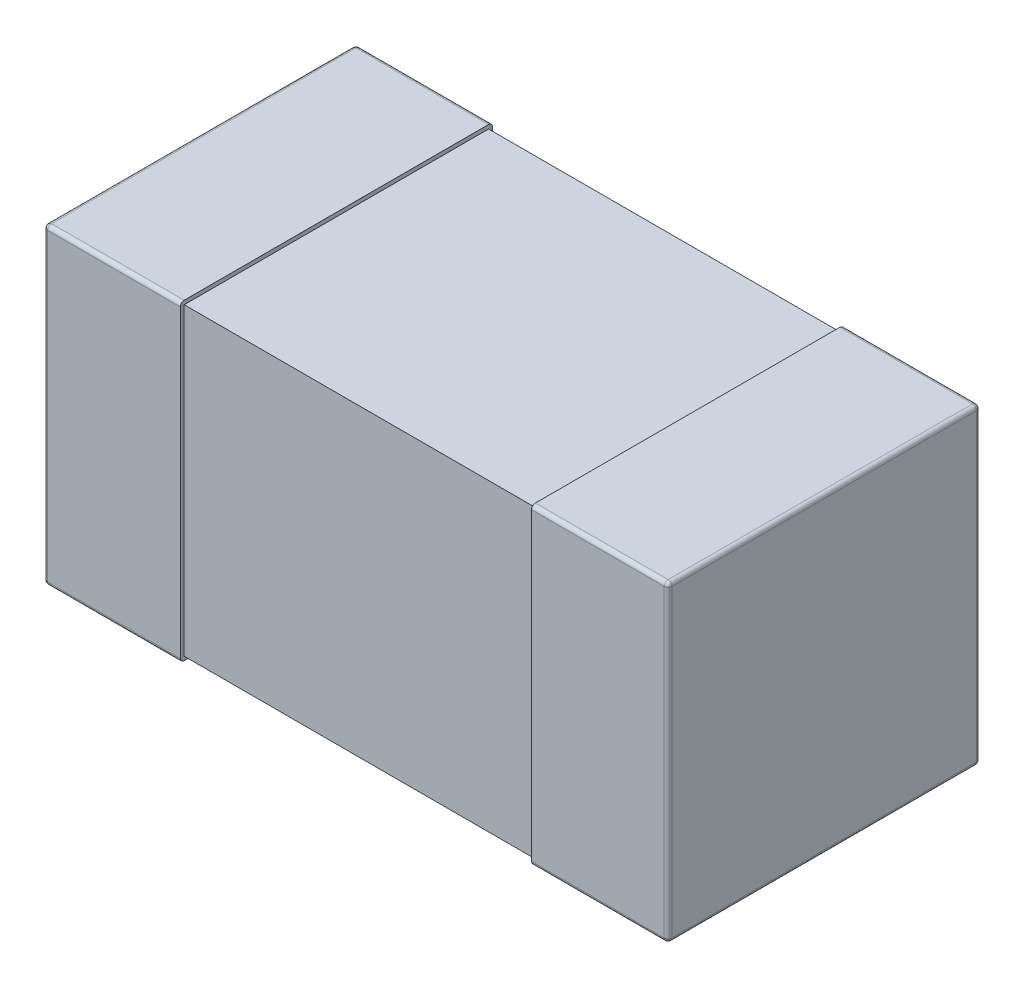
ISO-10303-21;
HEADER;
FILE_DESCRIPTION(('STEP AP214'),'2;1');
FILE_NAME('part.step','',(''),(''),'','','');
FILE_SCHEMA(('AUTOMOTIVE_DESIGN { 1 0 10303 214 1 1 1 1 }'));
ENDSEC;
DATA;
#1=APPLICATION_CONTEXT('core data for automotive mechanical design processes');
#2=APPLICATION_PROTOCOL_DEFINITION('international standard','automotive_design',2000,#1);
#3=PRODUCT_CONTEXT('',#1,'mechanical');
#4=PRODUCT('Part','Part','',(#3));
#5=PRODUCT_RELATED_PRODUCT_CATEGORY('part','',(#4));
#6=PRODUCT_DEFINITION_FORMATION('','',#4);
#7=PRODUCT_DEFINITION_CONTEXT('part definition',#1,'design');
#8=PRODUCT_DEFINITION('design','',#6,#7);
#9=PRODUCT_DEFINITION_SHAPE('','',#8);
#10=(LENGTH_UNIT() NAMED_UNIT(*) SI_UNIT(.MILLI.,.METRE.));
#11=(NAMED_UNIT(*) PLANE_ANGLE_UNIT() SI_UNIT($,.RADIAN.));
#12=(NAMED_UNIT(*) SI_UNIT($,.STERADIAN.) SOLID_ANGLE_UNIT());
#13=UNCERTAINTY_MEASURE_WITH_UNIT(LENGTH_MEASURE(1.E-05),#10,'distance_accuracy_value','');
#14=(GEOMETRIC_REPRESENTATION_CONTEXT(3) GLOBAL_UNCERTAINTY_ASSIGNED_CONTEXT((#13)) GLOBAL_UNIT_ASSIGNED_CONTEXT((#10,
#11,#12)) REPRESENTATION_CONTEXT('',''));
#15=CARTESIAN_POINT('',(0.,0.,0.));
#16=DIRECTION('',(0.,0.,1.));
#17=DIRECTION('',(1.,0.,0.));
#18=AXIS2_PLACEMENT_3D('',#15,#16,#17);
#19=CARTESIAN_POINT('',(-0.8,0.4,-0.4));
#20=DIRECTION('',(1.,0.,0.));
#21=DIRECTION('',(0.,0.,-1.));
#22=AXIS2_PLACEMENT_3D('',#19,#20,#21);
#23=PLANE('',#22);
#24=DIRECTION('',(0.,-1.,0.));
#25=VECTOR('',#24,1.);
#26=CARTESIAN_POINT('',(-0.8,0.4,-0.39));
#27=LINE('',#26,#25);
#28=CARTESIAN_POINT('',(-0.8,0.39,-0.39));
#29=VERTEX_POINT('',#28);
#30=CARTESIAN_POINT('',(-0.8,-0.39,-0.39));
#31=VERTEX_POINT('',#30);
#32=EDGE_CURVE('E352',#29,#31,#27,.T.);
#33=ORIENTED_EDGE('',*,*,#32,.T.);
#34=DIRECTION('',(0.,0.,1.));
#35=VECTOR('',#34,1.);
#36=CARTESIAN_POINT('',(-0.8,-0.39,-0.4));
#37=LINE('',#36,#35);
#38=CARTESIAN_POINT('',(-0.8,-0.39,0.39));
#39=VERTEX_POINT('',#38);
#40=EDGE_CURVE('E354',#31,#39,#37,.T.);
#41=ORIENTED_EDGE('',*,*,#40,.T.);
#42=DIRECTION('',(0.,-1.,0.));
#43=VECTOR('',#42,1.);
#44=CARTESIAN_POINT('',(-0.8,0.4,0.39));
#45=LINE('',#44,#43);
#46=CARTESIAN_POINT('',(-0.8,0.39,0.39));
#47=VERTEX_POINT('',#46);
#48=EDGE_CURVE('E350',#39,#47,#45,.F.);
#49=ORIENTED_EDGE('',*,*,#48,.T.);
#50=DIRECTION('',(0.,0.,1.));
#51=VECTOR('',#50,1.);
#52=CARTESIAN_POINT('',(-0.8,0.39,-0.4));
#53=LINE('',#52,#51);
#54=EDGE_CURVE('E348',#47,#29,#53,.F.);
#55=ORIENTED_EDGE('',*,*,#54,.T.);
#56=EDGE_LOOP('',(#33,#41,#49,#55));
#57=FACE_BOUND('',#56,.T.);
#58=ADVANCED_FACE('F37',(#57),#23,.F.);
#59=CARTESIAN_POINT('',(-0.8,0.4,0.4));
#60=DIRECTION('',(0.,0.,-1.));
#61=DIRECTION('',(-1.,0.,0.));
#62=AXIS2_PLACEMENT_3D('',#59,#60,#61);
#63=PLANE('',#62);
#64=DIRECTION('',(0.,-1.,0.));
#65=VECTOR('',#64,1.);
#66=CARTESIAN_POINT('',(-0.79,0.4,0.4));
#67=LINE('',#66,#65);
#68=CARTESIAN_POINT('',(-0.79,0.39,0.4));
#69=VERTEX_POINT('',#68);
#70=CARTESIAN_POINT('',(-0.79,-0.39,0.4));
#71=VERTEX_POINT('',#70);
#72=EDGE_CURVE('E380',#69,#71,#67,.T.);
#73=ORIENTED_EDGE('',*,*,#72,.T.);
#74=DIRECTION('',(1.,0.,0.));
#75=VECTOR('',#74,1.);
#76=CARTESIAN_POINT('',(-0.8,-0.39,0.4));
#77=LINE('',#76,#75);
#78=CARTESIAN_POINT('',(-0.45,-0.39,0.4));
#79=VERTEX_POINT('',#78);
#80=EDGE_CURVE('E382',#71,#79,#77,.T.);
#81=ORIENTED_EDGE('',*,*,#80,.T.);
#82=DIRECTION('',(0.,-1.,0.));
#83=VECTOR('',#82,1.);
#84=CARTESIAN_POINT('',(-0.45,0.4,0.4));
#85=LINE('',#84,#83);
#86=CARTESIAN_POINT('',(-0.45,0.39,0.4));
#87=VERTEX_POINT('',#86);
#88=EDGE_CURVE('E345',#87,#79,#85,.T.);
#89=ORIENTED_EDGE('',*,*,#88,.F.);
#90=DIRECTION('',(1.,0.,0.));
#91=VECTOR('',#90,1.);
#92=CARTESIAN_POINT('',(-0.8,0.39,0.4));
#93=LINE('',#92,#91);
#94=EDGE_CURVE('E378',#87,#69,#93,.F.);
#95=ORIENTED_EDGE('',*,*,#94,.T.);
#96=EDGE_LOOP('',(#73,#81,#89,#95));
#97=FACE_BOUND('',#96,.T.);
#98=ADVANCED_FACE('F451',(#97),#63,.F.);
#99=CARTESIAN_POINT('',(-0.45,0.4,-0.4));
#100=DIRECTION('',(-1.,0.,0.));
#101=DIRECTION('',(0.,0.,1.));
#102=AXIS2_PLACEMENT_3D('',#99,#100,#101);
#103=PLANE('',#102);
#104=DIRECTION('',(0.,1.,0.));
#105=VECTOR('',#104,1.);
#106=CARTESIAN_POINT('',(-0.45,0.39,-0.39));
#107=LINE('',#106,#105);
#108=CARTESIAN_POINT('',(-0.450000000000001,-0.39,-0.39));
#109=VERTEX_POINT('',#108);
#110=CARTESIAN_POINT('',(-0.45,0.39,-0.39));
#111=VERTEX_POINT('',#110);
#112=EDGE_CURVE('E211',#109,#111,#107,.T.);
#113=ORIENTED_EDGE('',*,*,#112,.F.);
#114=DIRECTION('',(0.,0.,-1.));
#115=VECTOR('',#114,1.);
#116=CARTESIAN_POINT('',(-0.45,-0.39,0.39));
#117=LINE('',#116,#115);
#118=CARTESIAN_POINT('',(-0.45,-0.39,0.39));
#119=VERTEX_POINT('',#118);
#120=EDGE_CURVE('E206',#119,#109,#117,.T.);
#121=ORIENTED_EDGE('',*,*,#120,.F.);
#122=DIRECTION('',(0.,-1.,0.));
#123=VECTOR('',#122,1.);
#124=CARTESIAN_POINT('',(-0.45,0.39,0.39));
#125=LINE('',#124,#123);
#126=CARTESIAN_POINT('',(-0.45,0.39,0.39));
#127=VERTEX_POINT('',#126);
#128=EDGE_CURVE('E327',#127,#119,#125,.T.);
#129=ORIENTED_EDGE('',*,*,#128,.F.);
#130=DIRECTION('',(0.,0.,1.));
#131=VECTOR('',#130,1.);
#132=CARTESIAN_POINT('',(-0.45,0.39,0.39));
#133=LINE('',#132,#131);
#134=EDGE_CURVE('E54',#111,#127,#133,.T.);
#135=ORIENTED_EDGE('',*,*,#134,.F.);
#136=EDGE_LOOP('',(#113,#121,#129,#135));
#137=FACE_BOUND('',#136,.T.);
#138=DIRECTION('',(0.,0.,-1.));
#139=VECTOR('',#138,1.);
#140=CARTESIAN_POINT('',(-0.45,-0.4,-0.4));
#141=LINE('',#140,#139);
#142=CARTESIAN_POINT('',(-0.45,-0.4,0.39));
#143=VERTEX_POINT('',#142);
#144=CARTESIAN_POINT('',(-0.45,-0.4,-0.39));
#145=VERTEX_POINT('',#144);
#146=EDGE_CURVE('E340',#143,#145,#141,.T.);
#147=ORIENTED_EDGE('',*,*,#146,.T.);
#148=CARTESIAN_POINT('',(-0.45,-0.39,-0.39));
#149=DIRECTION('',(-1.,0.,0.));
#150=DIRECTION('',(0.,0.,1.));
#151=AXIS2_PLACEMENT_3D('',#148,#149,#150);
#152=CIRCLE('',#151,0.01);
#153=CARTESIAN_POINT('',(-0.45,-0.39,-0.4));
#154=VERTEX_POINT('',#153);
#155=EDGE_CURVE('E376',#145,#154,#152,.F.);
#156=ORIENTED_EDGE('',*,*,#155,.T.);
#157=DIRECTION('',(0.,-1.,0.));
#158=VECTOR('',#157,1.);
#159=CARTESIAN_POINT('',(-0.45,0.4,-0.4));
#160=LINE('',#159,#158);
#161=CARTESIAN_POINT('',(-0.45,0.39,-0.4));
#162=VERTEX_POINT('',#161);
#163=EDGE_CURVE('E339',#162,#154,#160,.T.);
#164=ORIENTED_EDGE('',*,*,#163,.F.);
#165=CARTESIAN_POINT('',(-0.45,0.39,-0.39));
#166=DIRECTION('',(-1.,0.,0.));
#167=DIRECTION('',(0.,0.,1.));
#168=AXIS2_PLACEMENT_3D('',#165,#166,#167);
#169=CIRCLE('',#168,0.01);
#170=CARTESIAN_POINT('',(-0.45,0.4,-0.39));
#171=VERTEX_POINT('',#170);
#172=EDGE_CURVE('E372',#162,#171,#169,.F.);
#173=ORIENTED_EDGE('',*,*,#172,.T.);
#174=DIRECTION('',(0.,0.,-1.));
#175=VECTOR('',#174,1.);
#176=CARTESIAN_POINT('',(-0.45,0.4,-0.4));
#177=LINE('',#176,#175);
#178=CARTESIAN_POINT('',(-0.45,0.4,0.39));
#179=VERTEX_POINT('',#178);
#180=EDGE_CURVE('E337',#179,#171,#177,.T.);
#181=ORIENTED_EDGE('',*,*,#180,.F.);
#182=CARTESIAN_POINT('',(-0.45,0.39,0.39));
#183=DIRECTION('',(-1.,0.,0.));
#184=DIRECTION('',(0.,0.,1.));
#185=AXIS2_PLACEMENT_3D('',#182,#183,#184);
#186=CIRCLE('',#185,0.01);
#187=EDGE_CURVE('E370',#179,#87,#186,.F.);
#188=ORIENTED_EDGE('',*,*,#187,.T.);
#189=ORIENTED_EDGE('',*,*,#88,.T.);
#190=CARTESIAN_POINT('',(-0.45,-0.39,0.39));
#191=DIRECTION('',(-1.,0.,0.));
#192=DIRECTION('',(0.,0.,1.));
#193=AXIS2_PLACEMENT_3D('',#190,#191,#192);
#194=CIRCLE('',#193,0.01);
#195=EDGE_CURVE('E374',#79,#143,#194,.F.);
#196=ORIENTED_EDGE('',*,*,#195,.T.);
#197=EDGE_LOOP('',(#147,#156,#164,#173,#181,#188,#189,#196));
#198=FACE_BOUND('',#197,.T.);
#199=ADVANCED_FACE('F448',(#137,#198),#103,.F.);
#200=CARTESIAN_POINT('',(-0.8,0.4,-0.4));
#201=DIRECTION('',(0.,0.,1.));
#202=DIRECTION('',(1.,0.,0.));
#203=AXIS2_PLACEMENT_3D('',#200,#201,#202);
#204=PLANE('',#203);
#205=ORIENTED_EDGE('',*,*,#163,.T.);
#206=DIRECTION('',(-1.,0.,0.));
#207=VECTOR('',#206,1.);
#208=CARTESIAN_POINT('',(-0.8,-0.39,-0.4));
#209=LINE('',#208,#207);
#210=CARTESIAN_POINT('',(-0.79,-0.39,-0.4));
#211=VERTEX_POINT('',#210);
#212=EDGE_CURVE('E368',#154,#211,#209,.T.);
#213=ORIENTED_EDGE('',*,*,#212,.T.);
#214=DIRECTION('',(0.,-1.,0.));
#215=VECTOR('',#214,1.);
#216=CARTESIAN_POINT('',(-0.79,0.4,-0.4));
#217=LINE('',#216,#215);
#218=CARTESIAN_POINT('',(-0.79,0.39,-0.4));
#219=VERTEX_POINT('',#218);
#220=EDGE_CURVE('E366',#211,#219,#217,.F.);
#221=ORIENTED_EDGE('',*,*,#220,.T.);
#222=DIRECTION('',(-1.,0.,0.));
#223=VECTOR('',#222,1.);
#224=CARTESIAN_POINT('',(-0.45,0.39,-0.4));
#225=LINE('',#224,#223);
#226=EDGE_CURVE('E364',#219,#162,#225,.F.);
#227=ORIENTED_EDGE('',*,*,#226,.T.);
#228=EDGE_LOOP('',(#205,#213,#221,#227));
#229=FACE_BOUND('',#228,.T.);
#230=ADVANCED_FACE('F477',(#229),#204,.F.);
#231=CARTESIAN_POINT('',(-0.8,0.4,0.4));
#232=DIRECTION('',(0.,1.,0.));
#233=DIRECTION('',(0.,0.,1.));
#234=AXIS2_PLACEMENT_3D('',#231,#232,#233);
#235=PLANE('',#234);
#236=ORIENTED_EDGE('',*,*,#180,.T.);
#237=DIRECTION('',(-1.,0.,0.));
#238=VECTOR('',#237,1.);
#239=CARTESIAN_POINT('',(-0.8,0.4,-0.39));
#240=LINE('',#239,#238);
#241=CARTESIAN_POINT('',(-0.79,0.4,-0.39));
#242=VERTEX_POINT('',#241);
#243=EDGE_CURVE('E11',#171,#242,#240,.T.);
#244=ORIENTED_EDGE('',*,*,#243,.T.);
#245=DIRECTION('',(0.,0.,1.));
#246=VECTOR('',#245,1.);
#247=CARTESIAN_POINT('',(-0.79,0.4,0.4));
#248=LINE('',#247,#246);
#249=CARTESIAN_POINT('',(-0.79,0.4,0.39));
#250=VERTEX_POINT('',#249);
#251=EDGE_CURVE('E46',#242,#250,#248,.T.);
#252=ORIENTED_EDGE('',*,*,#251,.T.);
#253=DIRECTION('',(1.,0.,0.));
#254=VECTOR('',#253,1.);
#255=CARTESIAN_POINT('',(-0.45,0.4,0.39));
#256=LINE('',#255,#254);
#257=EDGE_CURVE('E384',#250,#179,#256,.T.);
#258=ORIENTED_EDGE('',*,*,#257,.T.);
#259=EDGE_LOOP('',(#236,#244,#252,#258));
#260=FACE_BOUND('',#259,.T.);
#261=ADVANCED_FACE('F438',(#260),#235,.T.);
#262=CARTESIAN_POINT('',(-0.8,-0.4,0.4));
#263=DIRECTION('',(0.,1.,0.));
#264=DIRECTION('',(0.,0.,1.));
#265=AXIS2_PLACEMENT_3D('',#262,#263,#264);
#266=PLANE('',#265);
#267=DIRECTION('',(0.,0.,1.));
#268=VECTOR('',#267,1.);
#269=CARTESIAN_POINT('',(-0.79,-0.4,0.4));
#270=LINE('',#269,#268);
#271=CARTESIAN_POINT('',(-0.79,-0.4,0.39));
#272=VERTEX_POINT('',#271);
#273=CARTESIAN_POINT('',(-0.79,-0.4,-0.39));
#274=VERTEX_POINT('',#273);
#275=EDGE_CURVE('E359',#272,#274,#270,.F.);
#276=ORIENTED_EDGE('',*,*,#275,.T.);
#277=DIRECTION('',(-1.,0.,0.));
#278=VECTOR('',#277,1.);
#279=CARTESIAN_POINT('',(-0.8,-0.4,-0.39));
#280=LINE('',#279,#278);
#281=EDGE_CURVE('E362',#274,#145,#280,.F.);
#282=ORIENTED_EDGE('',*,*,#281,.T.);
#283=ORIENTED_EDGE('',*,*,#146,.F.);
#284=DIRECTION('',(1.,0.,0.));
#285=VECTOR('',#284,1.);
#286=CARTESIAN_POINT('',(-0.8,-0.4,0.39));
#287=LINE('',#286,#285);
#288=EDGE_CURVE('E357',#143,#272,#287,.F.);
#289=ORIENTED_EDGE('',*,*,#288,.T.);
#290=EDGE_LOOP('',(#276,#282,#283,#289));
#291=FACE_BOUND('',#290,.T.);
#292=ADVANCED_FACE('F468',(#291),#266,.F.);
#293=CARTESIAN_POINT('',(-0.8,0.39,-0.39));
#294=DIRECTION('',(1.,0.,0.));
#295=DIRECTION('',(0.,0.,-1.));
#296=AXIS2_PLACEMENT_3D('',#293,#294,#295);
#297=CYLINDRICAL_SURFACE('',#296,0.01);
#298=ORIENTED_EDGE('',*,*,#172,.F.);
#299=ORIENTED_EDGE('',*,*,#226,.F.);
#300=CARTESIAN_POINT('',(-0.79,0.39,-0.39));
#301=DIRECTION('',(-1.,0.,0.));
#302=DIRECTION('',(0.,0.,1.));
#303=AXIS2_PLACEMENT_3D('',#300,#301,#302);
#304=CIRCLE('',#303,0.01);
#305=EDGE_CURVE('E41',#242,#219,#304,.T.);
#306=ORIENTED_EDGE('',*,*,#305,.F.);
#307=ORIENTED_EDGE('',*,*,#243,.F.);
#308=EDGE_LOOP('',(#298,#299,#306,#307));
#309=FACE_BOUND('',#308,.T.);
#310=ADVANCED_FACE('F39',(#309),#297,.T.);
#311=CARTESIAN_POINT('',(-0.79,0.39,0.4));
#312=DIRECTION('',(0.,0.,-1.));
#313=DIRECTION('',(-1.,0.,0.));
#314=AXIS2_PLACEMENT_3D('',#311,#312,#313);
#315=CYLINDRICAL_SURFACE('',#314,0.01);
#316=CARTESIAN_POINT('',(-0.79,0.39,0.39));
#317=DIRECTION('',(0.,0.,1.));
#318=DIRECTION('',(1.,0.,0.));
#319=AXIS2_PLACEMENT_3D('',#316,#317,#318);
#320=CIRCLE('',#319,0.01);
#321=EDGE_CURVE('E411',#250,#47,#320,.T.);
#322=ORIENTED_EDGE('',*,*,#321,.F.);
#323=ORIENTED_EDGE('',*,*,#251,.F.);
#324=CARTESIAN_POINT('',(-0.79,0.39,-0.39));
#325=DIRECTION('',(0.,0.,-1.));
#326=DIRECTION('',(-1.,0.,0.));
#327=AXIS2_PLACEMENT_3D('',#324,#325,#326);
#328=CIRCLE('',#327,0.01);
#329=EDGE_CURVE('E413',#29,#242,#328,.T.);
#330=ORIENTED_EDGE('',*,*,#329,.F.);
#331=ORIENTED_EDGE('',*,*,#54,.F.);
#332=EDGE_LOOP('',(#322,#323,#330,#331));
#333=FACE_BOUND('',#332,.T.);
#334=ADVANCED_FACE('F436',(#333),#315,.T.);
#335=CARTESIAN_POINT('',(-0.8,0.39,0.39));
#336=DIRECTION('',(-1.,0.,0.));
#337=DIRECTION('',(0.,0.,1.));
#338=AXIS2_PLACEMENT_3D('',#335,#336,#337);
#339=CYLINDRICAL_SURFACE('',#338,0.01);
#340=ORIENTED_EDGE('',*,*,#187,.F.);
#341=ORIENTED_EDGE('',*,*,#257,.F.);
#342=CARTESIAN_POINT('',(-0.79,0.39,0.39));
#343=DIRECTION('',(-1.,0.,0.));
#344=DIRECTION('',(0.,0.,1.));
#345=AXIS2_PLACEMENT_3D('',#342,#343,#344);
#346=CIRCLE('',#345,0.01);
#347=EDGE_CURVE('E408',#69,#250,#346,.T.);
#348=ORIENTED_EDGE('',*,*,#347,.F.);
#349=ORIENTED_EDGE('',*,*,#94,.F.);
#350=EDGE_LOOP('',(#340,#341,#348,#349));
#351=FACE_BOUND('',#350,.T.);
#352=ADVANCED_FACE('F443',(#351),#339,.T.);
#353=CARTESIAN_POINT('',(-0.79,0.39,-0.39));
#354=DIRECTION('',(0.,0.,1.));
#355=DIRECTION('',(1.,0.,0.));
#356=AXIS2_PLACEMENT_3D('',#353,#354,#355);
#357=SPHERICAL_SURFACE('',#356,0.01);
#358=ORIENTED_EDGE('',*,*,#329,.T.);
#359=ORIENTED_EDGE('',*,*,#305,.T.);
#360=CARTESIAN_POINT('',(-0.79,0.39,-0.39));
#361=DIRECTION('',(0.,1.,0.));
#362=DIRECTION('',(0.,0.,1.));
#363=AXIS2_PLACEMENT_3D('',#360,#361,#362);
#364=CIRCLE('',#363,0.01);
#365=EDGE_CURVE('E405',#29,#219,#364,.F.);
#366=ORIENTED_EDGE('',*,*,#365,.F.);
#367=EDGE_LOOP('',(#358,#359,#366));
#368=FACE_BOUND('',#367,.T.);
#369=ADVANCED_FACE('F420',(#368),#357,.T.);
#370=CARTESIAN_POINT('',(-0.79,0.39,0.39));
#371=DIRECTION('',(0.,0.,1.));
#372=DIRECTION('',(1.,0.,0.));
#373=AXIS2_PLACEMENT_3D('',#370,#371,#372);
#374=SPHERICAL_SURFACE('',#373,0.01);
#375=ORIENTED_EDGE('',*,*,#347,.T.);
#376=ORIENTED_EDGE('',*,*,#321,.T.);
#377=CARTESIAN_POINT('',(-0.79,0.39,0.39));
#378=DIRECTION('',(0.,1.,0.));
#379=DIRECTION('',(0.,0.,1.));
#380=AXIS2_PLACEMENT_3D('',#377,#378,#379);
#381=CIRCLE('',#380,0.01);
#382=EDGE_CURVE('E402',#69,#47,#381,.F.);
#383=ORIENTED_EDGE('',*,*,#382,.F.);
#384=EDGE_LOOP('',(#375,#376,#383));
#385=FACE_BOUND('',#384,.T.);
#386=ADVANCED_FACE('F509',(#385),#374,.T.);
#387=CARTESIAN_POINT('',(-0.8,-0.39,-0.39));
#388=DIRECTION('',(-1.,0.,0.));
#389=DIRECTION('',(0.,0.,1.));
#390=AXIS2_PLACEMENT_3D('',#387,#388,#389);
#391=CYLINDRICAL_SURFACE('',#390,0.01);
#392=ORIENTED_EDGE('',*,*,#155,.F.);
#393=ORIENTED_EDGE('',*,*,#281,.F.);
#394=CARTESIAN_POINT('',(-0.79,-0.39,-0.39));
#395=DIRECTION('',(-1.,0.,0.));
#396=DIRECTION('',(0.,0.,1.));
#397=AXIS2_PLACEMENT_3D('',#394,#395,#396);
#398=CIRCLE('',#397,0.01);
#399=EDGE_CURVE('E399',#211,#274,#398,.T.);
#400=ORIENTED_EDGE('',*,*,#399,.F.);
#401=ORIENTED_EDGE('',*,*,#212,.F.);
#402=EDGE_LOOP('',(#392,#393,#400,#401));
#403=FACE_BOUND('',#402,.T.);
#404=ADVANCED_FACE('F475',(#403),#391,.T.);
#405=CARTESIAN_POINT('',(-0.79,0.4,-0.39));
#406=DIRECTION('',(0.,-1.,0.));
#407=DIRECTION('',(0.,0.,-1.));
#408=AXIS2_PLACEMENT_3D('',#405,#406,#407);
#409=CYLINDRICAL_SURFACE('',#408,0.01);
#410=ORIENTED_EDGE('',*,*,#365,.T.);
#411=ORIENTED_EDGE('',*,*,#220,.F.);
#412=CARTESIAN_POINT('',(-0.79,-0.39,-0.39));
#413=DIRECTION('',(0.,-1.,0.));
#414=DIRECTION('',(0.,0.,-1.));
#415=AXIS2_PLACEMENT_3D('',#412,#413,#414);
#416=CIRCLE('',#415,0.01);
#417=EDGE_CURVE('E396',#31,#211,#416,.T.);
#418=ORIENTED_EDGE('',*,*,#417,.F.);
#419=ORIENTED_EDGE('',*,*,#32,.F.);
#420=EDGE_LOOP('',(#410,#411,#418,#419));
#421=FACE_BOUND('',#420,.T.);
#422=ADVANCED_FACE('F426',(#421),#409,.T.);
#423=CARTESIAN_POINT('',(-0.79,0.4,0.39));
#424=DIRECTION('',(0.,-1.,0.));
#425=DIRECTION('',(0.,0.,-1.));
#426=AXIS2_PLACEMENT_3D('',#423,#424,#425);
#427=CYLINDRICAL_SURFACE('',#426,0.01);
#428=ORIENTED_EDGE('',*,*,#382,.T.);
#429=ORIENTED_EDGE('',*,*,#48,.F.);
#430=CARTESIAN_POINT('',(-0.79,-0.39,0.39));
#431=DIRECTION('',(0.,-1.,0.));
#432=DIRECTION('',(0.,0.,-1.));
#433=AXIS2_PLACEMENT_3D('',#430,#431,#432);
#434=CIRCLE('',#433,0.01);
#435=EDGE_CURVE('E393',#71,#39,#434,.T.);
#436=ORIENTED_EDGE('',*,*,#435,.F.);
#437=ORIENTED_EDGE('',*,*,#72,.F.);
#438=EDGE_LOOP('',(#428,#429,#436,#437));
#439=FACE_BOUND('',#438,.T.);
#440=ADVANCED_FACE('F461',(#439),#427,.T.);
#441=CARTESIAN_POINT('',(-0.8,-0.39,0.39));
#442=DIRECTION('',(1.,0.,0.));
#443=DIRECTION('',(0.,0.,-1.));
#444=AXIS2_PLACEMENT_3D('',#441,#442,#443);
#445=CYLINDRICAL_SURFACE('',#444,0.01);
#446=ORIENTED_EDGE('',*,*,#195,.F.);
#447=ORIENTED_EDGE('',*,*,#80,.F.);
#448=CARTESIAN_POINT('',(-0.79,-0.39,0.39));
#449=DIRECTION('',(-1.,0.,0.));
#450=DIRECTION('',(0.,0.,1.));
#451=AXIS2_PLACEMENT_3D('',#448,#449,#450);
#452=CIRCLE('',#451,0.01);
#453=EDGE_CURVE('E390',#272,#71,#452,.T.);
#454=ORIENTED_EDGE('',*,*,#453,.F.);
#455=ORIENTED_EDGE('',*,*,#288,.F.);
#456=EDGE_LOOP('',(#446,#447,#454,#455));
#457=FACE_BOUND('',#456,.T.);
#458=ADVANCED_FACE('F457',(#457),#445,.T.);
#459=CARTESIAN_POINT('',(-0.79,-0.39,-0.39));
#460=DIRECTION('',(0.,0.,1.));
#461=DIRECTION('',(1.,0.,0.));
#462=AXIS2_PLACEMENT_3D('',#459,#460,#461);
#463=SPHERICAL_SURFACE('',#462,0.01);
#464=ORIENTED_EDGE('',*,*,#417,.T.);
#465=ORIENTED_EDGE('',*,*,#399,.T.);
#466=CARTESIAN_POINT('',(-0.79,-0.39,-0.39));
#467=DIRECTION('',(0.,0.,-1.));
#468=DIRECTION('',(-1.,0.,0.));
#469=AXIS2_PLACEMENT_3D('',#466,#467,#468);
#470=CIRCLE('',#469,0.01);
#471=EDGE_CURVE('E388',#31,#274,#470,.F.);
#472=ORIENTED_EDGE('',*,*,#471,.F.);
#473=EDGE_LOOP('',(#464,#465,#472));
#474=FACE_BOUND('',#473,.T.);
#475=ADVANCED_FACE('F497',(#474),#463,.T.);
#476=CARTESIAN_POINT('',(-0.79,-0.39,0.39));
#477=DIRECTION('',(0.,0.,1.));
#478=DIRECTION('',(1.,0.,0.));
#479=AXIS2_PLACEMENT_3D('',#476,#477,#478);
#480=SPHERICAL_SURFACE('',#479,0.01);
#481=ORIENTED_EDGE('',*,*,#453,.T.);
#482=ORIENTED_EDGE('',*,*,#435,.T.);
#483=CARTESIAN_POINT('',(-0.79,-0.39,0.39));
#484=DIRECTION('',(0.,0.,1.));
#485=DIRECTION('',(1.,0.,0.));
#486=AXIS2_PLACEMENT_3D('',#483,#484,#485);
#487=CIRCLE('',#486,0.01);
#488=EDGE_CURVE('E336',#272,#39,#487,.F.);
#489=ORIENTED_EDGE('',*,*,#488,.F.);
#490=EDGE_LOOP('',(#481,#482,#489));
#491=FACE_BOUND('',#490,.T.);
#492=ADVANCED_FACE('F464',(#491),#480,.T.);
#493=CARTESIAN_POINT('',(-0.79,-0.39,-0.4));
#494=DIRECTION('',(0.,0.,1.));
#495=DIRECTION('',(1.,0.,0.));
#496=AXIS2_PLACEMENT_3D('',#493,#494,#495);
#497=CYLINDRICAL_SURFACE('',#496,0.01);
#498=ORIENTED_EDGE('',*,*,#471,.T.);
#499=ORIENTED_EDGE('',*,*,#275,.F.);
#500=ORIENTED_EDGE('',*,*,#488,.T.);
#501=ORIENTED_EDGE('',*,*,#40,.F.);
#502=EDGE_LOOP('',(#498,#499,#500,#501));
#503=FACE_BOUND('',#502,.T.);
#504=ADVANCED_FACE('F466',(#503),#497,.T.);
#505=CARTESIAN_POINT('',(-1.55308657865101,-0.39,0.39));
#506=DIRECTION('',(0.,-1.,0.));
#507=DIRECTION('',(0.,0.,-1.));
#508=AXIS2_PLACEMENT_3D('',#505,#506,#507);
#509=PLANE('',#508);
#510=DIRECTION('',(1.,0.,0.));
#511=VECTOR('',#510,1.);
#512=CARTESIAN_POINT('',(-1.55308657865101,-0.39,0.39));
#513=LINE('',#512,#511);
#514=CARTESIAN_POINT('',(0.45,-0.39,0.39));
#515=VERTEX_POINT('',#514);
#516=EDGE_CURVE('E329',#119,#515,#513,.T.);
#517=ORIENTED_EDGE('',*,*,#516,.F.);
#518=ORIENTED_EDGE('',*,*,#120,.T.);
#519=DIRECTION('',(1.,0.,0.));
#520=VECTOR('',#519,1.);
#521=CARTESIAN_POINT('',(-1.55308657865101,-0.39,-0.39));
#522=LINE('',#521,#520);
#523=CARTESIAN_POINT('',(0.450000000000001,-0.39,-0.39));
#524=VERTEX_POINT('',#523);
#525=EDGE_CURVE('E199',#109,#524,#522,.T.);
#526=ORIENTED_EDGE('',*,*,#525,.T.);
#527=DIRECTION('',(0.,0.,-1.));
#528=VECTOR('',#527,1.);
#529=CARTESIAN_POINT('',(0.45,-0.39,0.39));
#530=LINE('',#529,#528);
#531=EDGE_CURVE('E203',#515,#524,#530,.T.);
#532=ORIENTED_EDGE('',*,*,#531,.F.);
#533=EDGE_LOOP('',(#517,#518,#526,#532));
#534=FACE_BOUND('',#533,.T.);
#535=ADVANCED_FACE('F202',(#534),#509,.T.);
#536=CARTESIAN_POINT('',(-1.55308657865101,0.39,-0.39));
#537=DIRECTION('',(0.,0.,-1.));
#538=DIRECTION('',(-1.,0.,0.));
#539=AXIS2_PLACEMENT_3D('',#536,#537,#538);
#540=PLANE('',#539);
#541=ORIENTED_EDGE('',*,*,#525,.F.);
#542=ORIENTED_EDGE('',*,*,#112,.T.);
#543=DIRECTION('',(1.,0.,0.));
#544=VECTOR('',#543,1.);
#545=CARTESIAN_POINT('',(-1.55308657865101,0.39,-0.39));
#546=LINE('',#545,#544);
#547=CARTESIAN_POINT('',(0.45,0.39,-0.39));
#548=VERTEX_POINT('',#547);
#549=EDGE_CURVE('E223',#111,#548,#546,.T.);
#550=ORIENTED_EDGE('',*,*,#549,.T.);
#551=DIRECTION('',(0.,1.,0.));
#552=VECTOR('',#551,1.);
#553=CARTESIAN_POINT('',(0.45,0.39,-0.39));
#554=LINE('',#553,#552);
#555=EDGE_CURVE('E218',#524,#548,#554,.T.);
#556=ORIENTED_EDGE('',*,*,#555,.F.);
#557=EDGE_LOOP('',(#541,#542,#550,#556));
#558=FACE_BOUND('',#557,.T.);
#559=ADVANCED_FACE('F222',(#558),#540,.T.);
#560=CARTESIAN_POINT('',(-1.55308657865101,0.39,0.39));
#561=DIRECTION('',(0.,1.,0.));
#562=DIRECTION('',(0.,0.,1.));
#563=AXIS2_PLACEMENT_3D('',#560,#561,#562);
#564=PLANE('',#563);
#565=ORIENTED_EDGE('',*,*,#549,.F.);
#566=ORIENTED_EDGE('',*,*,#134,.T.);
#567=DIRECTION('',(1.,0.,0.));
#568=VECTOR('',#567,1.);
#569=CARTESIAN_POINT('',(-1.55308657865101,0.39,0.39));
#570=LINE('',#569,#568);
#571=CARTESIAN_POINT('',(0.45,0.39,0.39));
#572=VERTEX_POINT('',#571);
#573=EDGE_CURVE('E330',#127,#572,#570,.T.);
#574=ORIENTED_EDGE('',*,*,#573,.T.);
#575=DIRECTION('',(0.,0.,1.));
#576=VECTOR('',#575,1.);
#577=CARTESIAN_POINT('',(0.45,0.39,0.39));
#578=LINE('',#577,#576);
#579=EDGE_CURVE('E225',#548,#572,#578,.T.);
#580=ORIENTED_EDGE('',*,*,#579,.F.);
#581=EDGE_LOOP('',(#565,#566,#574,#580));
#582=FACE_BOUND('',#581,.T.);
#583=ADVANCED_FACE('F569',(#582),#564,.T.);
#584=CARTESIAN_POINT('',(-1.55308657865101,0.39,0.39));
#585=DIRECTION('',(0.,0.,1.));
#586=DIRECTION('',(1.,0.,0.));
#587=AXIS2_PLACEMENT_3D('',#584,#585,#586);
#588=PLANE('',#587);
#589=ORIENTED_EDGE('',*,*,#573,.F.);
#590=ORIENTED_EDGE('',*,*,#128,.T.);
#591=ORIENTED_EDGE('',*,*,#516,.T.);
#592=DIRECTION('',(0.,-1.,0.));
#593=VECTOR('',#592,1.);
#594=CARTESIAN_POINT('',(0.45,0.39,0.39));
#595=LINE('',#594,#593);
#596=EDGE_CURVE('E220',#572,#515,#595,.T.);
#597=ORIENTED_EDGE('',*,*,#596,.F.);
#598=EDGE_LOOP('',(#589,#590,#591,#597));
#599=FACE_BOUND('',#598,.T.);
#600=ADVANCED_FACE('F576',(#599),#588,.T.);
#601=CARTESIAN_POINT('',(0.8,0.4,-0.4));
#602=DIRECTION('',(-1.,0.,0.));
#603=DIRECTION('',(0.,0.,-1.));
#604=AXIS2_PLACEMENT_3D('',#601,#602,#603);
#605=PLANE('',#604);
#606=DIRECTION('',(0.,-1.,0.));
#607=VECTOR('',#606,1.);
#608=CARTESIAN_POINT('',(0.8,0.4,-0.39));
#609=LINE('',#608,#607);
#610=CARTESIAN_POINT('',(0.8,0.39,-0.39));
#611=VERTEX_POINT('',#610);
#612=CARTESIAN_POINT('',(0.8,-0.39,-0.39));
#613=VERTEX_POINT('',#612);
#614=EDGE_CURVE('E249',#611,#613,#609,.T.);
#615=ORIENTED_EDGE('',*,*,#614,.F.);
#616=DIRECTION('',(0.,0.,1.));
#617=VECTOR('',#616,1.);
#618=CARTESIAN_POINT('',(0.8,0.39,-0.4));
#619=LINE('',#618,#617);
#620=CARTESIAN_POINT('',(0.8,0.39,0.39));
#621=VERTEX_POINT('',#620);
#622=EDGE_CURVE('E243',#621,#611,#619,.F.);
#623=ORIENTED_EDGE('',*,*,#622,.F.);
#624=DIRECTION('',(0.,-1.,0.));
#625=VECTOR('',#624,1.);
#626=CARTESIAN_POINT('',(0.8,0.4,0.39));
#627=LINE('',#626,#625);
#628=CARTESIAN_POINT('',(0.8,-0.39,0.39));
#629=VERTEX_POINT('',#628);
#630=EDGE_CURVE('E246',#629,#621,#627,.F.);
#631=ORIENTED_EDGE('',*,*,#630,.F.);
#632=DIRECTION('',(0.,0.,1.));
#633=VECTOR('',#632,1.);
#634=CARTESIAN_POINT('',(0.8,-0.39,-0.4));
#635=LINE('',#634,#633);
#636=EDGE_CURVE('E252',#613,#629,#635,.T.);
#637=ORIENTED_EDGE('',*,*,#636,.F.);
#638=EDGE_LOOP('',(#615,#623,#631,#637));
#639=FACE_BOUND('',#638,.T.);
#640=ADVANCED_FACE('F583',(#639),#605,.F.);
#641=CARTESIAN_POINT('',(0.8,0.4,0.4));
#642=DIRECTION('',(0.,0.,-1.));
#643=DIRECTION('',(1.,0.,0.));
#644=AXIS2_PLACEMENT_3D('',#641,#642,#643);
#645=PLANE('',#644);
#646=DIRECTION('',(0.,-1.,0.));
#647=VECTOR('',#646,1.);
#648=CARTESIAN_POINT('',(0.79,0.4,0.4));
#649=LINE('',#648,#647);
#650=CARTESIAN_POINT('',(0.79,0.39,0.4));
#651=VERTEX_POINT('',#650);
#652=CARTESIAN_POINT('',(0.79,-0.39,0.4));
#653=VERTEX_POINT('',#652);
#654=EDGE_CURVE('E285',#651,#653,#649,.T.);
#655=ORIENTED_EDGE('',*,*,#654,.F.);
#656=DIRECTION('',(-1.,0.,0.));
#657=VECTOR('',#656,1.);
#658=CARTESIAN_POINT('',(0.8,0.39,0.4));
#659=LINE('',#658,#657);
#660=CARTESIAN_POINT('',(0.45,0.39,0.4));
#661=VERTEX_POINT('',#660);
#662=EDGE_CURVE('E282',#661,#651,#659,.F.);
#663=ORIENTED_EDGE('',*,*,#662,.F.);
#664=DIRECTION('',(0.,-1.,0.));
#665=VECTOR('',#664,1.);
#666=CARTESIAN_POINT('',(0.45,0.4,0.4));
#667=LINE('',#666,#665);
#668=CARTESIAN_POINT('',(0.45,-0.39,0.4));
#669=VERTEX_POINT('',#668);
#670=EDGE_CURVE('E240',#661,#669,#667,.T.);
#671=ORIENTED_EDGE('',*,*,#670,.T.);
#672=DIRECTION('',(-1.,0.,0.));
#673=VECTOR('',#672,1.);
#674=CARTESIAN_POINT('',(0.8,-0.39,0.4));
#675=LINE('',#674,#673);
#676=EDGE_CURVE('E288',#653,#669,#675,.T.);
#677=ORIENTED_EDGE('',*,*,#676,.F.);
#678=EDGE_LOOP('',(#655,#663,#671,#677));
#679=FACE_BOUND('',#678,.T.);
#680=ADVANCED_FACE('F592',(#679),#645,.F.);
#681=CARTESIAN_POINT('',(0.45,0.4,-0.4));
#682=DIRECTION('',(1.,0.,0.));
#683=DIRECTION('',(0.,0.,1.));
#684=AXIS2_PLACEMENT_3D('',#681,#682,#683);
#685=PLANE('',#684);
#686=ORIENTED_EDGE('',*,*,#555,.T.);
#687=ORIENTED_EDGE('',*,*,#579,.T.);
#688=ORIENTED_EDGE('',*,*,#596,.T.);
#689=ORIENTED_EDGE('',*,*,#531,.T.);
#690=EDGE_LOOP('',(#686,#687,#688,#689));
#691=FACE_BOUND('',#690,.T.);
#692=DIRECTION('',(0.,0.,-1.));
#693=VECTOR('',#692,1.);
#694=CARTESIAN_POINT('',(0.45,-0.4,-0.4));
#695=LINE('',#694,#693);
#696=CARTESIAN_POINT('',(0.45,-0.4,0.39));
#697=VERTEX_POINT('',#696);
#698=CARTESIAN_POINT('',(0.45,-0.4,-0.39));
#699=VERTEX_POINT('',#698);
#700=EDGE_CURVE('E234',#697,#699,#695,.T.);
#701=ORIENTED_EDGE('',*,*,#700,.F.);
#702=CARTESIAN_POINT('',(0.45,-0.39,0.39));
#703=DIRECTION('',(-1.,0.,0.));
#704=DIRECTION('',(0.,0.,1.));
#705=AXIS2_PLACEMENT_3D('',#702,#703,#704);
#706=CIRCLE('',#705,0.01);
#707=EDGE_CURVE('E276',#669,#697,#706,.F.);
#708=ORIENTED_EDGE('',*,*,#707,.F.);
#709=ORIENTED_EDGE('',*,*,#670,.F.);
#710=CARTESIAN_POINT('',(0.45,0.39,0.39));
#711=DIRECTION('',(-1.,0.,0.));
#712=DIRECTION('',(0.,0.,1.));
#713=AXIS2_PLACEMENT_3D('',#710,#711,#712);
#714=CIRCLE('',#713,0.01);
#715=CARTESIAN_POINT('',(0.45,0.4,0.39));
#716=VERTEX_POINT('',#715);
#717=EDGE_CURVE('E271',#716,#661,#714,.F.);
#718=ORIENTED_EDGE('',*,*,#717,.F.);
#719=DIRECTION('',(0.,0.,-1.));
#720=VECTOR('',#719,1.);
#721=CARTESIAN_POINT('',(0.45,0.4,-0.4));
#722=LINE('',#721,#720);
#723=CARTESIAN_POINT('',(0.45,0.4,-0.39));
#724=VERTEX_POINT('',#723);
#725=EDGE_CURVE('E230',#716,#724,#722,.T.);
#726=ORIENTED_EDGE('',*,*,#725,.T.);
#727=CARTESIAN_POINT('',(0.45,0.39,-0.39));
#728=DIRECTION('',(-1.,0.,0.));
#729=DIRECTION('',(0.,0.,1.));
#730=AXIS2_PLACEMENT_3D('',#727,#728,#729);
#731=CIRCLE('',#730,0.01);
#732=CARTESIAN_POINT('',(0.45,0.39,-0.4));
#733=VERTEX_POINT('',#732);
#734=EDGE_CURVE('E273',#733,#724,#731,.F.);
#735=ORIENTED_EDGE('',*,*,#734,.F.);
#736=DIRECTION('',(0.,-1.,0.));
#737=VECTOR('',#736,1.);
#738=CARTESIAN_POINT('',(0.45,0.4,-0.4));
#739=LINE('',#738,#737);
#740=CARTESIAN_POINT('',(0.45,-0.39,-0.4));
#741=VERTEX_POINT('',#740);
#742=EDGE_CURVE('E233',#733,#741,#739,.T.);
#743=ORIENTED_EDGE('',*,*,#742,.T.);
#744=CARTESIAN_POINT('',(0.45,-0.39,-0.39));
#745=DIRECTION('',(-1.,0.,0.));
#746=DIRECTION('',(0.,0.,1.));
#747=AXIS2_PLACEMENT_3D('',#744,#745,#746);
#748=CIRCLE('',#747,0.01);
#749=EDGE_CURVE('E279',#699,#741,#748,.F.);
#750=ORIENTED_EDGE('',*,*,#749,.F.);
#751=EDGE_LOOP('',(#701,#708,#709,#718,#726,#735,#743,#750));
#752=FACE_BOUND('',#751,.T.);
#753=ADVANCED_FACE('F215',(#691,#752),#685,.F.);
#754=CARTESIAN_POINT('',(0.8,0.4,-0.4));
#755=DIRECTION('',(0.,0.,1.));
#756=DIRECTION('',(-1.,0.,0.));
#757=AXIS2_PLACEMENT_3D('',#754,#755,#756);
#758=PLANE('',#757);
#759=ORIENTED_EDGE('',*,*,#742,.F.);
#760=DIRECTION('',(1.,0.,0.));
#761=VECTOR('',#760,1.);
#762=CARTESIAN_POINT('',(0.45,0.39,-0.4));
#763=LINE('',#762,#761);
#764=CARTESIAN_POINT('',(0.79,0.39,-0.4));
#765=VERTEX_POINT('',#764);
#766=EDGE_CURVE('E263',#765,#733,#763,.F.);
#767=ORIENTED_EDGE('',*,*,#766,.F.);
#768=DIRECTION('',(0.,-1.,0.));
#769=VECTOR('',#768,1.);
#770=CARTESIAN_POINT('',(0.79,0.4,-0.4));
#771=LINE('',#770,#769);
#772=CARTESIAN_POINT('',(0.79,-0.39,-0.4));
#773=VERTEX_POINT('',#772);
#774=EDGE_CURVE('E265',#773,#765,#771,.F.);
#775=ORIENTED_EDGE('',*,*,#774,.F.);
#776=DIRECTION('',(1.,0.,0.));
#777=VECTOR('',#776,1.);
#778=CARTESIAN_POINT('',(0.8,-0.39,-0.4));
#779=LINE('',#778,#777);
#780=EDGE_CURVE('E268',#741,#773,#779,.T.);
#781=ORIENTED_EDGE('',*,*,#780,.F.);
#782=EDGE_LOOP('',(#759,#767,#775,#781));
#783=FACE_BOUND('',#782,.T.);
#784=ADVANCED_FACE('F606',(#783),#758,.F.);
#785=CARTESIAN_POINT('',(0.8,0.4,0.4));
#786=DIRECTION('',(0.,1.,0.));
#787=DIRECTION('',(0.,0.,1.));
#788=AXIS2_PLACEMENT_3D('',#785,#786,#787);
#789=PLANE('',#788);
#790=ORIENTED_EDGE('',*,*,#725,.F.);
#791=DIRECTION('',(-1.,0.,0.));
#792=VECTOR('',#791,1.);
#793=CARTESIAN_POINT('',(0.45,0.4,0.39));
#794=LINE('',#793,#792);
#795=CARTESIAN_POINT('',(0.79,0.4,0.39));
#796=VERTEX_POINT('',#795);
#797=EDGE_CURVE('E291',#796,#716,#794,.T.);
#798=ORIENTED_EDGE('',*,*,#797,.F.);
#799=DIRECTION('',(0.,0.,1.));
#800=VECTOR('',#799,1.);
#801=CARTESIAN_POINT('',(0.79,0.4,0.4));
#802=LINE('',#801,#800);
#803=CARTESIAN_POINT('',(0.79,0.4,-0.39));
#804=VERTEX_POINT('',#803);
#805=EDGE_CURVE('E293',#804,#796,#802,.T.);
#806=ORIENTED_EDGE('',*,*,#805,.F.);
#807=DIRECTION('',(1.,0.,0.));
#808=VECTOR('',#807,1.);
#809=CARTESIAN_POINT('',(0.8,0.4,-0.39));
#810=LINE('',#809,#808);
#811=EDGE_CURVE('E296',#724,#804,#810,.T.);
#812=ORIENTED_EDGE('',*,*,#811,.F.);
#813=EDGE_LOOP('',(#790,#798,#806,#812));
#814=FACE_BOUND('',#813,.T.);
#815=ADVANCED_FACE('F613',(#814),#789,.T.);
#816=CARTESIAN_POINT('',(0.8,-0.4,0.4));
#817=DIRECTION('',(0.,1.,0.));
#818=DIRECTION('',(0.,0.,1.));
#819=AXIS2_PLACEMENT_3D('',#816,#817,#818);
#820=PLANE('',#819);
#821=DIRECTION('',(0.,0.,1.));
#822=VECTOR('',#821,1.);
#823=CARTESIAN_POINT('',(0.79,-0.4,0.4));
#824=LINE('',#823,#822);
#825=CARTESIAN_POINT('',(0.79,-0.4,0.39));
#826=VERTEX_POINT('',#825);
#827=CARTESIAN_POINT('',(0.79,-0.4,-0.39));
#828=VERTEX_POINT('',#827);
#829=EDGE_CURVE('E258',#826,#828,#824,.F.);
#830=ORIENTED_EDGE('',*,*,#829,.F.);
#831=DIRECTION('',(-1.,0.,0.));
#832=VECTOR('',#831,1.);
#833=CARTESIAN_POINT('',(0.8,-0.4,0.39));
#834=LINE('',#833,#832);
#835=EDGE_CURVE('E255',#697,#826,#834,.F.);
#836=ORIENTED_EDGE('',*,*,#835,.F.);
#837=ORIENTED_EDGE('',*,*,#700,.T.);
#838=DIRECTION('',(1.,0.,0.));
#839=VECTOR('',#838,1.);
#840=CARTESIAN_POINT('',(0.8,-0.4,-0.39));
#841=LINE('',#840,#839);
#842=EDGE_CURVE('E261',#828,#699,#841,.F.);
#843=ORIENTED_EDGE('',*,*,#842,.F.);
#844=EDGE_LOOP('',(#830,#836,#837,#843));
#845=FACE_BOUND('',#844,.T.);
#846=ADVANCED_FACE('F621',(#845),#820,.F.);
#847=CARTESIAN_POINT('',(0.8,0.39,-0.39));
#848=DIRECTION('',(-1.,0.,0.));
#849=DIRECTION('',(0.,0.,-1.));
#850=AXIS2_PLACEMENT_3D('',#847,#848,#849);
#851=CYLINDRICAL_SURFACE('',#850,0.01);
#852=ORIENTED_EDGE('',*,*,#734,.T.);
#853=ORIENTED_EDGE('',*,*,#811,.T.);
#854=CARTESIAN_POINT('',(0.79,0.39,-0.39));
#855=DIRECTION('',(-1.,0.,0.));
#856=DIRECTION('',(0.,0.,1.));
#857=AXIS2_PLACEMENT_3D('',#854,#855,#856);
#858=CIRCLE('',#857,0.01);
#859=EDGE_CURVE('E237',#804,#765,#858,.T.);
#860=ORIENTED_EDGE('',*,*,#859,.T.);
#861=ORIENTED_EDGE('',*,*,#766,.T.);
#862=EDGE_LOOP('',(#852,#853,#860,#861));
#863=FACE_BOUND('',#862,.T.);
#864=ADVANCED_FACE('F629',(#863),#851,.T.);
#865=CARTESIAN_POINT('',(0.79,0.39,0.4));
#866=DIRECTION('',(0.,0.,-1.));
#867=DIRECTION('',(1.,0.,0.));
#868=AXIS2_PLACEMENT_3D('',#865,#866,#867);
#869=CYLINDRICAL_SURFACE('',#868,0.01);
#870=CARTESIAN_POINT('',(0.79,0.39,0.39));
#871=DIRECTION('',(0.,0.,-1.));
#872=DIRECTION('',(-1.,0.,0.));
#873=AXIS2_PLACEMENT_3D('',#870,#871,#872);
#874=CIRCLE('',#873,0.01);
#875=EDGE_CURVE('E319',#796,#621,#874,.T.);
#876=ORIENTED_EDGE('',*,*,#875,.T.);
#877=ORIENTED_EDGE('',*,*,#622,.T.);
#878=CARTESIAN_POINT('',(0.79,0.39,-0.39));
#879=DIRECTION('',(0.,0.,1.));
#880=DIRECTION('',(1.,0.,0.));
#881=AXIS2_PLACEMENT_3D('',#878,#879,#880);
#882=CIRCLE('',#881,0.01);
#883=EDGE_CURVE('E322',#611,#804,#882,.T.);
#884=ORIENTED_EDGE('',*,*,#883,.T.);
#885=ORIENTED_EDGE('',*,*,#805,.T.);
#886=EDGE_LOOP('',(#876,#877,#884,#885));
#887=FACE_BOUND('',#886,.T.);
#888=ADVANCED_FACE('F637',(#887),#869,.T.);
#889=CARTESIAN_POINT('',(0.8,0.39,0.39));
#890=DIRECTION('',(1.,0.,0.));
#891=DIRECTION('',(0.,0.,1.));
#892=AXIS2_PLACEMENT_3D('',#889,#890,#891);
#893=CYLINDRICAL_SURFACE('',#892,0.01);
#894=ORIENTED_EDGE('',*,*,#717,.T.);
#895=ORIENTED_EDGE('',*,*,#662,.T.);
#896=CARTESIAN_POINT('',(0.79,0.39,0.39));
#897=DIRECTION('',(-1.,0.,0.));
#898=DIRECTION('',(0.,0.,1.));
#899=AXIS2_PLACEMENT_3D('',#896,#897,#898);
#900=CIRCLE('',#899,0.01);
#901=EDGE_CURVE('E317',#651,#796,#900,.T.);
#902=ORIENTED_EDGE('',*,*,#901,.T.);
#903=ORIENTED_EDGE('',*,*,#797,.T.);
#904=EDGE_LOOP('',(#894,#895,#902,#903));
#905=FACE_BOUND('',#904,.T.);
#906=ADVANCED_FACE('F645',(#905),#893,.T.);
#907=CARTESIAN_POINT('',(0.79,0.39,-0.39));
#908=DIRECTION('',(0.,0.,1.));
#909=DIRECTION('',(-1.,0.,0.));
#910=AXIS2_PLACEMENT_3D('',#907,#908,#909);
#911=SPHERICAL_SURFACE('',#910,0.01);
#912=ORIENTED_EDGE('',*,*,#883,.F.);
#913=CARTESIAN_POINT('',(0.79,0.39,-0.39));
#914=DIRECTION('',(0.,-1.,0.));
#915=DIRECTION('',(0.,0.,1.));
#916=AXIS2_PLACEMENT_3D('',#913,#914,#915);
#917=CIRCLE('',#916,0.01);
#918=EDGE_CURVE('E315',#611,#765,#917,.F.);
#919=ORIENTED_EDGE('',*,*,#918,.T.);
#920=ORIENTED_EDGE('',*,*,#859,.F.);
#921=EDGE_LOOP('',(#912,#919,#920));
#922=FACE_BOUND('',#921,.T.);
#923=ADVANCED_FACE('F653',(#922),#911,.T.);
#924=CARTESIAN_POINT('',(0.79,0.39,0.39));
#925=DIRECTION('',(0.,0.,1.));
#926=DIRECTION('',(-1.,0.,0.));
#927=AXIS2_PLACEMENT_3D('',#924,#925,#926);
#928=SPHERICAL_SURFACE('',#927,0.01);
#929=ORIENTED_EDGE('',*,*,#901,.F.);
#930=CARTESIAN_POINT('',(0.79,0.39,0.39));
#931=DIRECTION('',(0.,-1.,0.));
#932=DIRECTION('',(0.,0.,1.));
#933=AXIS2_PLACEMENT_3D('',#930,#931,#932);
#934=CIRCLE('',#933,0.01);
#935=EDGE_CURVE('E313',#651,#621,#934,.F.);
#936=ORIENTED_EDGE('',*,*,#935,.T.);
#937=ORIENTED_EDGE('',*,*,#875,.F.);
#938=EDGE_LOOP('',(#929,#936,#937));
#939=FACE_BOUND('',#938,.T.);
#940=ADVANCED_FACE('F662',(#939),#928,.T.);
#941=CARTESIAN_POINT('',(0.8,-0.39,-0.39));
#942=DIRECTION('',(1.,0.,0.));
#943=DIRECTION('',(0.,0.,1.));
#944=AXIS2_PLACEMENT_3D('',#941,#942,#943);
#945=CYLINDRICAL_SURFACE('',#944,0.01);
#946=ORIENTED_EDGE('',*,*,#749,.T.);
#947=ORIENTED_EDGE('',*,*,#780,.T.);
#948=CARTESIAN_POINT('',(0.79,-0.39,-0.39));
#949=DIRECTION('',(-1.,0.,0.));
#950=DIRECTION('',(0.,0.,1.));
#951=AXIS2_PLACEMENT_3D('',#948,#949,#950);
#952=CIRCLE('',#951,0.01);
#953=EDGE_CURVE('E310',#773,#828,#952,.T.);
#954=ORIENTED_EDGE('',*,*,#953,.T.);
#955=ORIENTED_EDGE('',*,*,#842,.T.);
#956=EDGE_LOOP('',(#946,#947,#954,#955));
#957=FACE_BOUND('',#956,.T.);
#958=ADVANCED_FACE('F671',(#957),#945,.T.);
#959=CARTESIAN_POINT('',(0.79,0.4,-0.39));
#960=DIRECTION('',(0.,-1.,0.));
#961=DIRECTION('',(0.,0.,-1.));
#962=AXIS2_PLACEMENT_3D('',#959,#960,#961);
#963=CYLINDRICAL_SURFACE('',#962,0.01);
#964=ORIENTED_EDGE('',*,*,#918,.F.);
#965=ORIENTED_EDGE('',*,*,#614,.T.);
#966=CARTESIAN_POINT('',(0.79,-0.39,-0.39));
#967=DIRECTION('',(0.,1.,0.));
#968=DIRECTION('',(0.,0.,-1.));
#969=AXIS2_PLACEMENT_3D('',#966,#967,#968);
#970=CIRCLE('',#969,0.01);
#971=EDGE_CURVE('E308',#613,#773,#970,.T.);
#972=ORIENTED_EDGE('',*,*,#971,.T.);
#973=ORIENTED_EDGE('',*,*,#774,.T.);
#974=EDGE_LOOP('',(#964,#965,#972,#973));
#975=FACE_BOUND('',#974,.T.);
#976=ADVANCED_FACE('F679',(#975),#963,.T.);
#977=CARTESIAN_POINT('',(0.79,0.4,0.39));
#978=DIRECTION('',(0.,-1.,0.));
#979=DIRECTION('',(0.,0.,-1.));
#980=AXIS2_PLACEMENT_3D('',#977,#978,#979);
#981=CYLINDRICAL_SURFACE('',#980,0.01);
#982=ORIENTED_EDGE('',*,*,#935,.F.);
#983=ORIENTED_EDGE('',*,*,#654,.T.);
#984=CARTESIAN_POINT('',(0.79,-0.39,0.39));
#985=DIRECTION('',(0.,1.,0.));
#986=DIRECTION('',(0.,0.,-1.));
#987=AXIS2_PLACEMENT_3D('',#984,#985,#986);
#988=CIRCLE('',#987,0.01);
#989=EDGE_CURVE('E305',#653,#629,#988,.T.);
#990=ORIENTED_EDGE('',*,*,#989,.T.);
#991=ORIENTED_EDGE('',*,*,#630,.T.);
#992=EDGE_LOOP('',(#982,#983,#990,#991));
#993=FACE_BOUND('',#992,.T.);
#994=ADVANCED_FACE('F687',(#993),#981,.T.);
#995=CARTESIAN_POINT('',(0.8,-0.39,0.39));
#996=DIRECTION('',(-1.,0.,0.));
#997=DIRECTION('',(0.,0.,-1.));
#998=AXIS2_PLACEMENT_3D('',#995,#996,#997);
#999=CYLINDRICAL_SURFACE('',#998,0.01);
#1000=ORIENTED_EDGE('',*,*,#707,.T.);
#1001=ORIENTED_EDGE('',*,*,#835,.T.);
#1002=CARTESIAN_POINT('',(0.79,-0.39,0.39));
#1003=DIRECTION('',(-1.,0.,0.));
#1004=DIRECTION('',(0.,0.,1.));
#1005=AXIS2_PLACEMENT_3D('',#1002,#1003,#1004);
#1006=CIRCLE('',#1005,0.01);
#1007=EDGE_CURVE('E303',#826,#653,#1006,.T.);
#1008=ORIENTED_EDGE('',*,*,#1007,.T.);
#1009=ORIENTED_EDGE('',*,*,#676,.T.);
#1010=EDGE_LOOP('',(#1000,#1001,#1008,#1009));
#1011=FACE_BOUND('',#1010,.T.);
#1012=ADVANCED_FACE('F695',(#1011),#999,.T.);
#1013=CARTESIAN_POINT('',(0.79,-0.39,-0.39));
#1014=DIRECTION('',(0.,0.,1.));
#1015=DIRECTION('',(-1.,0.,0.));
#1016=AXIS2_PLACEMENT_3D('',#1013,#1014,#1015);
#1017=SPHERICAL_SURFACE('',#1016,0.01);
#1018=ORIENTED_EDGE('',*,*,#971,.F.);
#1019=CARTESIAN_POINT('',(0.79,-0.39,-0.39));
#1020=DIRECTION('',(0.,0.,1.));
#1021=DIRECTION('',(1.,0.,0.));
#1022=AXIS2_PLACEMENT_3D('',#1019,#1020,#1021);
#1023=CIRCLE('',#1022,0.01);
#1024=EDGE_CURVE('E301',#613,#828,#1023,.F.);
#1025=ORIENTED_EDGE('',*,*,#1024,.T.);
#1026=ORIENTED_EDGE('',*,*,#953,.F.);
#1027=EDGE_LOOP('',(#1018,#1025,#1026));
#1028=FACE_BOUND('',#1027,.T.);
#1029=ADVANCED_FACE('F702',(#1028),#1017,.T.);
#1030=CARTESIAN_POINT('',(0.79,-0.39,0.39));
#1031=DIRECTION('',(0.,0.,1.));
#1032=DIRECTION('',(-1.,0.,0.));
#1033=AXIS2_PLACEMENT_3D('',#1030,#1031,#1032);
#1034=SPHERICAL_SURFACE('',#1033,0.01);
#1035=ORIENTED_EDGE('',*,*,#1007,.F.);
#1036=CARTESIAN_POINT('',(0.79,-0.39,0.39));
#1037=DIRECTION('',(0.,0.,-1.));
#1038=DIRECTION('',(-1.,0.,0.));
#1039=AXIS2_PLACEMENT_3D('',#1036,#1037,#1038);
#1040=CIRCLE('',#1039,0.01);
#1041=EDGE_CURVE('E299',#826,#629,#1040,.F.);
#1042=ORIENTED_EDGE('',*,*,#1041,.T.);
#1043=ORIENTED_EDGE('',*,*,#989,.F.);
#1044=EDGE_LOOP('',(#1035,#1042,#1043));
#1045=FACE_BOUND('',#1044,.T.);
#1046=ADVANCED_FACE('F709',(#1045),#1034,.T.);
#1047=CARTESIAN_POINT('',(0.79,-0.39,-0.4));
#1048=DIRECTION('',(0.,0.,1.));
#1049=DIRECTION('',(-1.,0.,0.));
#1050=AXIS2_PLACEMENT_3D('',#1047,#1048,#1049);
#1051=CYLINDRICAL_SURFACE('',#1050,0.01);
#1052=ORIENTED_EDGE('',*,*,#1024,.F.);
#1053=ORIENTED_EDGE('',*,*,#636,.T.);
#1054=ORIENTED_EDGE('',*,*,#1041,.F.);
#1055=ORIENTED_EDGE('',*,*,#829,.T.);
#1056=EDGE_LOOP('',(#1052,#1053,#1054,#1055));
#1057=FACE_BOUND('',#1056,.T.);
#1058=ADVANCED_FACE('F717',(#1057),#1051,.T.);
#1059=CLOSED_SHELL('',(#58,#98,#199,#230,#261,#292,#310,#334,#352,#369,#386,#404,#422,#440,#458,
#475,#492,#504,#535,#559,#583,#600,#640,#680,#753,#784,#815,#846,#864,#888,#906,#923,#940,#958,
#976,#994,#1012,#1029,#1046,#1058));
#1060=MANIFOLD_SOLID_BREP('B2',#1059);
#1061=ADVANCED_BREP_SHAPE_REPRESENTATION('',(#18,#1060),#14);
#1062=SHAPE_DEFINITION_REPRESENTATION(#9,#1061);
ENDSEC;
END-ISO-10303-21;
